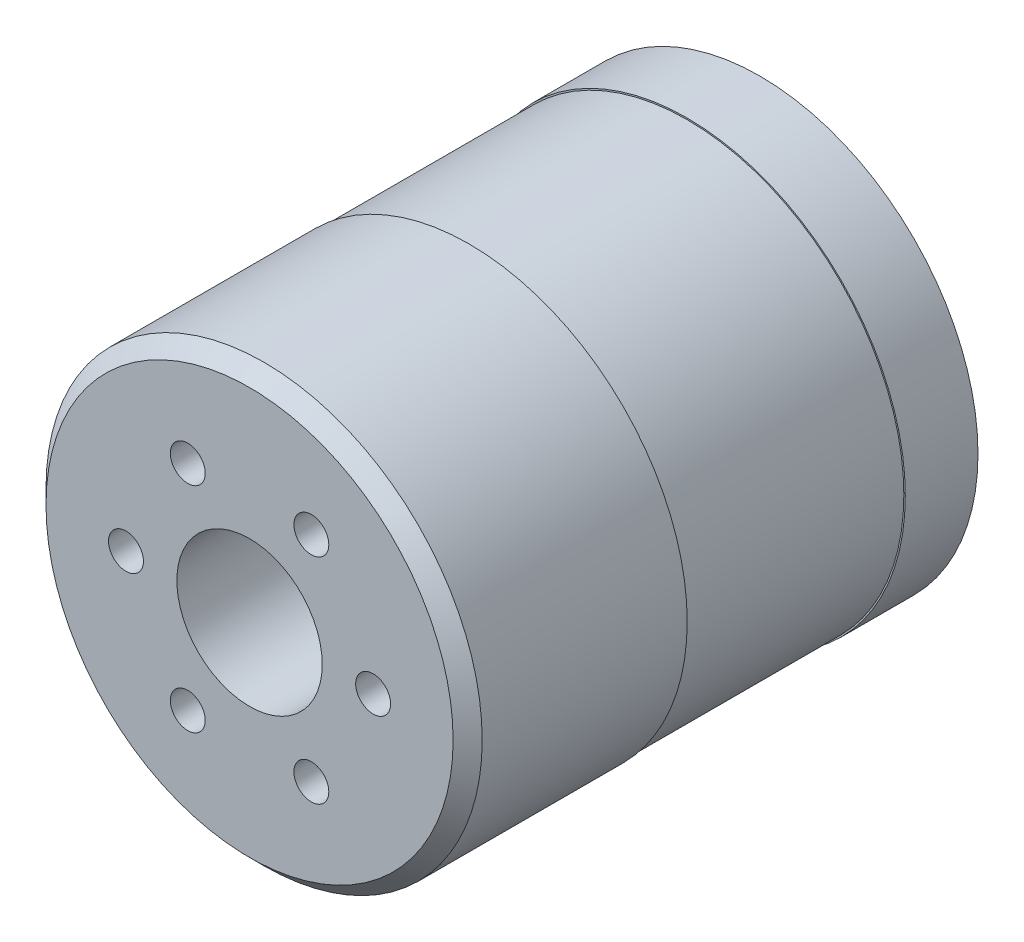
ISO-10303-21;
HEADER;
FILE_DESCRIPTION(('STEP AP214'),'2;1');
FILE_NAME('part.step','',(''),(''),'','','');
FILE_SCHEMA(('AUTOMOTIVE_DESIGN { 1 0 10303 214 1 1 1 1 }'));
ENDSEC;
DATA;
#1=APPLICATION_CONTEXT('core data for automotive mechanical design processes');
#2=APPLICATION_PROTOCOL_DEFINITION('international standard','automotive_design',2000,#1);
#3=PRODUCT_CONTEXT('',#1,'mechanical');
#4=PRODUCT('Part','Part','',(#3));
#5=PRODUCT_RELATED_PRODUCT_CATEGORY('part','',(#4));
#6=PRODUCT_DEFINITION_FORMATION('','',#4);
#7=PRODUCT_DEFINITION_CONTEXT('part definition',#1,'design');
#8=PRODUCT_DEFINITION('design','',#6,#7);
#9=PRODUCT_DEFINITION_SHAPE('','',#8);
#10=(LENGTH_UNIT() NAMED_UNIT(*) SI_UNIT(.MILLI.,.METRE.));
#11=(NAMED_UNIT(*) PLANE_ANGLE_UNIT() SI_UNIT($,.RADIAN.));
#12=(NAMED_UNIT(*) SI_UNIT($,.STERADIAN.) SOLID_ANGLE_UNIT());
#13=UNCERTAINTY_MEASURE_WITH_UNIT(LENGTH_MEASURE(1.E-05),#10,'distance_accuracy_value','');
#14=(GEOMETRIC_REPRESENTATION_CONTEXT(3) GLOBAL_UNCERTAINTY_ASSIGNED_CONTEXT((#13)) GLOBAL_UNIT_ASSIGNED_CONTEXT((#10,
#11,#12)) REPRESENTATION_CONTEXT('',''));
#15=CARTESIAN_POINT('',(0.,0.,0.));
#16=DIRECTION('',(0.,0.,1.));
#17=DIRECTION('',(1.,0.,0.));
#18=AXIS2_PLACEMENT_3D('',#15,#16,#17);
#19=CARTESIAN_POINT('',(0.,0.,0.));
#20=DIRECTION('',(0.,0.,1.));
#21=DIRECTION('',(1.,0.,0.));
#22=AXIS2_PLACEMENT_3D('',#19,#20,#21);
#23=PLANE('',#22);
#24=CARTESIAN_POINT('',(-13.,0.,0.));
#25=DIRECTION('',(0.,0.,-1.));
#26=DIRECTION('',(-1.,0.,0.));
#27=AXIS2_PLACEMENT_3D('',#24,#25,#26);
#28=CIRCLE('',#27,1.25);
#29=CARTESIAN_POINT('',(-14.25,0.,0.));
#30=VERTEX_POINT('',#29);
#31=EDGE_CURVE('E130',#30,#30,#28,.T.);
#32=ORIENTED_EDGE('',*,*,#31,.F.);
#33=EDGE_LOOP('',(#32));
#34=FACE_BOUND('',#33,.T.);
#35=CARTESIAN_POINT('',(0.,13.,0.));
#36=DIRECTION('',(0.,0.,-1.));
#37=DIRECTION('',(-1.,0.,0.));
#38=AXIS2_PLACEMENT_3D('',#35,#36,#37);
#39=CIRCLE('',#38,1.25);
#40=CARTESIAN_POINT('',(-1.25,13.,0.));
#41=VERTEX_POINT('',#40);
#42=EDGE_CURVE('E136',#41,#41,#39,.T.);
#43=ORIENTED_EDGE('',*,*,#42,.F.);
#44=EDGE_LOOP('',(#43));
#45=FACE_BOUND('',#44,.T.);
#46=CARTESIAN_POINT('',(13.,0.,0.));
#47=DIRECTION('',(0.,0.,-1.));
#48=DIRECTION('',(-1.,0.,0.));
#49=AXIS2_PLACEMENT_3D('',#46,#47,#48);
#50=CIRCLE('',#49,1.25);
#51=CARTESIAN_POINT('',(11.75,0.,0.));
#52=VERTEX_POINT('',#51);
#53=EDGE_CURVE('E142',#52,#52,#50,.T.);
#54=ORIENTED_EDGE('',*,*,#53,.F.);
#55=EDGE_LOOP('',(#54));
#56=FACE_BOUND('',#55,.T.);
#57=CARTESIAN_POINT('',(0.,-13.,0.));
#58=DIRECTION('',(0.,0.,-1.));
#59=DIRECTION('',(-1.,0.,0.));
#60=AXIS2_PLACEMENT_3D('',#57,#58,#59);
#61=CIRCLE('',#60,1.25);
#62=CARTESIAN_POINT('',(-1.25,-13.,0.));
#63=VERTEX_POINT('',#62);
#64=EDGE_CURVE('E148',#63,#63,#61,.T.);
#65=ORIENTED_EDGE('',*,*,#64,.F.);
#66=EDGE_LOOP('',(#65));
#67=FACE_BOUND('',#66,.T.);
#68=CARTESIAN_POINT('',(0.,0.,0.));
#69=DIRECTION('',(0.,0.,1.));
#70=DIRECTION('',(1.,0.,0.));
#71=AXIS2_PLACEMENT_3D('',#68,#69,#70);
#72=CIRCLE('',#71,9.);
#73=CARTESIAN_POINT('',(9.,0.,0.));
#74=VERTEX_POINT('',#73);
#75=EDGE_CURVE('E178',#74,#74,#72,.F.);
#76=ORIENTED_EDGE('',*,*,#75,.F.);
#77=EDGE_LOOP('',(#76));
#78=FACE_BOUND('',#77,.T.);
#79=CARTESIAN_POINT('',(0.,0.,0.));
#80=DIRECTION('',(0.,0.,-1.));
#81=DIRECTION('',(-1.,0.,0.));
#82=AXIS2_PLACEMENT_3D('',#79,#80,#81);
#83=CIRCLE('',#82,15.);
#84=CARTESIAN_POINT('',(-15.,0.,0.));
#85=VERTEX_POINT('',#84);
#86=EDGE_CURVE('E151',#85,#85,#83,.T.);
#87=ORIENTED_EDGE('',*,*,#86,.T.);
#88=EDGE_LOOP('',(#87));
#89=FACE_BOUND('',#88,.T.);
#90=ADVANCED_FACE('F36',(#34,#45,#56,#67,#78,#89),#23,.F.);
#91=CARTESIAN_POINT('',(0.,0.,-4.5));
#92=DIRECTION('',(0.,0.,-1.));
#93=DIRECTION('',(-1.,0.,0.));
#94=AXIS2_PLACEMENT_3D('',#91,#92,#93);
#95=PLANE('',#94);
#96=CARTESIAN_POINT('',(0.,0.,-4.5));
#97=DIRECTION('',(0.,0.,-1.));
#98=DIRECTION('',(-1.,0.,0.));
#99=AXIS2_PLACEMENT_3D('',#96,#97,#98);
#100=CIRCLE('',#99,5.);
#101=CARTESIAN_POINT('',(-5.,0.,-4.5));
#102=VERTEX_POINT('',#101);
#103=EDGE_CURVE('E170',#102,#102,#100,.T.);
#104=ORIENTED_EDGE('',*,*,#103,.T.);
#105=EDGE_LOOP('',(#104));
#106=FACE_BOUND('',#105,.T.);
#107=CARTESIAN_POINT('',(0.,0.,-4.5));
#108=DIRECTION('',(0.,0.,-1.));
#109=DIRECTION('',(-1.,0.,0.));
#110=AXIS2_PLACEMENT_3D('',#107,#108,#109);
#111=CIRCLE('',#110,4.);
#112=CARTESIAN_POINT('',(-4.,0.,-4.5));
#113=VERTEX_POINT('',#112);
#114=EDGE_CURVE('E166',#113,#113,#111,.T.);
#115=ORIENTED_EDGE('',*,*,#114,.F.);
#116=EDGE_LOOP('',(#115));
#117=FACE_BOUND('',#116,.T.);
#118=ADVANCED_FACE('F200',(#106,#117),#95,.T.);
#119=CARTESIAN_POINT('',(0.,0.,-4.));
#120=DIRECTION('',(0.,0.,-1.));
#121=DIRECTION('',(-1.,0.,0.));
#122=AXIS2_PLACEMENT_3D('',#119,#120,#121);
#123=PLANE('',#122);
#124=CARTESIAN_POINT('',(0.,0.,-4.));
#125=DIRECTION('',(0.,0.,-1.));
#126=DIRECTION('',(-1.,0.,0.));
#127=AXIS2_PLACEMENT_3D('',#124,#125,#126);
#128=CIRCLE('',#127,9.);
#129=CARTESIAN_POINT('',(-9.,0.,-4.));
#130=VERTEX_POINT('',#129);
#131=EDGE_CURVE('E173',#130,#130,#128,.T.);
#132=ORIENTED_EDGE('',*,*,#131,.T.);
#133=EDGE_LOOP('',(#132));
#134=FACE_BOUND('',#133,.T.);
#135=CARTESIAN_POINT('',(0.,0.,-4.));
#136=DIRECTION('',(0.,0.,-1.));
#137=DIRECTION('',(-1.,0.,0.));
#138=AXIS2_PLACEMENT_3D('',#135,#136,#137);
#139=CIRCLE('',#138,5.);
#140=CARTESIAN_POINT('',(-5.,0.,-4.));
#141=VERTEX_POINT('',#140);
#142=EDGE_CURVE('E169',#141,#141,#139,.T.);
#143=ORIENTED_EDGE('',*,*,#142,.F.);
#144=EDGE_LOOP('',(#143));
#145=FACE_BOUND('',#144,.T.);
#146=ADVANCED_FACE('F206',(#134,#145),#123,.T.);
#147=CARTESIAN_POINT('',(0.,0.,-4.));
#148=DIRECTION('',(0.,0.,1.));
#149=DIRECTION('',(1.,0.,0.));
#150=AXIS2_PLACEMENT_3D('',#147,#148,#149);
#151=CYLINDRICAL_SURFACE('',#150,9.);
#152=ORIENTED_EDGE('',*,*,#131,.F.);
#153=EDGE_LOOP('',(#152));
#154=FACE_BOUND('',#153,.T.);
#155=ORIENTED_EDGE('',*,*,#75,.T.);
#156=EDGE_LOOP('',(#155));
#157=FACE_BOUND('',#156,.T.);
#158=ADVANCED_FACE('F212',(#154,#157),#151,.T.);
#159=CARTESIAN_POINT('',(0.,0.,-4.5));
#160=DIRECTION('',(0.,0.,1.));
#161=DIRECTION('',(1.,0.,0.));
#162=AXIS2_PLACEMENT_3D('',#159,#160,#161);
#163=CYLINDRICAL_SURFACE('',#162,5.);
#164=ORIENTED_EDGE('',*,*,#103,.F.);
#165=EDGE_LOOP('',(#164));
#166=FACE_BOUND('',#165,.T.);
#167=ORIENTED_EDGE('',*,*,#142,.T.);
#168=EDGE_LOOP('',(#167));
#169=FACE_BOUND('',#168,.T.);
#170=ADVANCED_FACE('F215',(#166,#169),#163,.T.);
#171=CARTESIAN_POINT('',(0.,0.,-4.501));
#172=DIRECTION('',(0.,0.,1.));
#173=DIRECTION('',(1.,0.,0.));
#174=AXIS2_PLACEMENT_3D('',#171,#172,#173);
#175=CYLINDRICAL_SURFACE('',#174,4.);
#176=ORIENTED_EDGE('',*,*,#114,.T.);
#177=EDGE_LOOP('',(#176));
#178=FACE_BOUND('',#177,.T.);
#179=CARTESIAN_POINT('',(0.,0.,0.));
#180=DIRECTION('',(0.,0.,-1.));
#181=DIRECTION('',(-1.,0.,0.));
#182=AXIS2_PLACEMENT_3D('',#179,#180,#181);
#183=CIRCLE('',#182,4.);
#184=CARTESIAN_POINT('',(-4.,0.,0.));
#185=VERTEX_POINT('',#184);
#186=EDGE_CURVE('E163',#185,#185,#183,.T.);
#187=ORIENTED_EDGE('',*,*,#186,.F.);
#188=EDGE_LOOP('',(#187));
#189=FACE_BOUND('',#188,.T.);
#190=ADVANCED_FACE('F221',(#178,#189),#175,.F.);
#191=CARTESIAN_POINT('',(0.,0.,0.));
#192=DIRECTION('',(0.,0.,-1.));
#193=DIRECTION('',(-1.,0.,0.));
#194=AXIS2_PLACEMENT_3D('',#191,#192,#193);
#195=PLANE('',#194);
#196=ORIENTED_EDGE('',*,*,#186,.T.);
#197=EDGE_LOOP('',(#196));
#198=FACE_BOUND('',#197,.T.);
#199=ADVANCED_FACE('F226',(#198),#195,.T.);
#200=CARTESIAN_POINT('',(0.,0.,5.));
#201=DIRECTION('',(0.,0.,-1.));
#202=DIRECTION('',(-1.,0.,0.));
#203=AXIS2_PLACEMENT_3D('',#200,#201,#202);
#204=CYLINDRICAL_SURFACE('',#203,15.);
#205=CARTESIAN_POINT('',(0.,0.,5.));
#206=DIRECTION('',(0.,0.,-1.));
#207=DIRECTION('',(-1.,0.,0.));
#208=AXIS2_PLACEMENT_3D('',#205,#206,#207);
#209=CIRCLE('',#208,15.);
#210=CARTESIAN_POINT('',(-15.,0.,5.));
#211=VERTEX_POINT('',#210);
#212=EDGE_CURVE('E152',#211,#211,#209,.T.);
#213=ORIENTED_EDGE('',*,*,#212,.T.);
#214=EDGE_LOOP('',(#213));
#215=FACE_BOUND('',#214,.T.);
#216=ORIENTED_EDGE('',*,*,#86,.F.);
#217=EDGE_LOOP('',(#216));
#218=FACE_BOUND('',#217,.T.);
#219=ADVANCED_FACE('F230',(#215,#218),#204,.T.);
#220=CARTESIAN_POINT('',(0.,0.,5.));
#221=DIRECTION('',(0.,0.,-1.));
#222=DIRECTION('',(-1.,0.,0.));
#223=AXIS2_PLACEMENT_3D('',#220,#221,#222);
#224=PLANE('',#223);
#225=CARTESIAN_POINT('',(0.,0.,5.));
#226=DIRECTION('',(0.,0.,-1.));
#227=DIRECTION('',(-1.,0.,0.));
#228=AXIS2_PLACEMENT_3D('',#225,#226,#227);
#229=CIRCLE('',#228,14.9);
#230=CARTESIAN_POINT('',(-14.9,0.,5.));
#231=VERTEX_POINT('',#230);
#232=EDGE_CURVE('E40',#231,#231,#229,.F.);
#233=ORIENTED_EDGE('',*,*,#232,.F.);
#234=EDGE_LOOP('',(#233));
#235=FACE_BOUND('',#234,.T.);
#236=ORIENTED_EDGE('',*,*,#212,.F.);
#237=EDGE_LOOP('',(#236));
#238=FACE_BOUND('',#237,.T.);
#239=ADVANCED_FACE('F195',(#235,#238),#224,.F.);
#240=CARTESIAN_POINT('',(0.,0.,35.1));
#241=DIRECTION('',(0.,0.,1.));
#242=DIRECTION('',(1.,0.,0.));
#243=AXIS2_PLACEMENT_3D('',#240,#241,#242);
#244=PLANE('',#243);
#245=CARTESIAN_POINT('',(4.25000000000004,-7.36121593216771,35.1));
#246=DIRECTION('',(0.,0.,1.));
#247=DIRECTION('',(1.,0.,0.));
#248=AXIS2_PLACEMENT_3D('',#245,#246,#247);
#249=CIRCLE('',#248,1.19999999999999);
#250=CARTESIAN_POINT('',(5.45000000000003,-7.36121593216771,35.1));
#251=VERTEX_POINT('',#250);
#252=EDGE_CURVE('E87',#251,#251,#249,.T.);
#253=ORIENTED_EDGE('',*,*,#252,.F.);
#254=EDGE_LOOP('',(#253));
#255=FACE_BOUND('',#254,.T.);
#256=CARTESIAN_POINT('',(-4.24999999999998,-7.36121593216774,35.1));
#257=DIRECTION('',(0.,0.,1.));
#258=DIRECTION('',(1.,0.,0.));
#259=AXIS2_PLACEMENT_3D('',#256,#257,#258);
#260=CIRCLE('',#259,1.19999999999999);
#261=CARTESIAN_POINT('',(-3.04999999999999,-7.36121593216774,35.1));
#262=VERTEX_POINT('',#261);
#263=EDGE_CURVE('E86',#262,#262,#260,.T.);
#264=ORIENTED_EDGE('',*,*,#263,.F.);
#265=EDGE_LOOP('',(#264));
#266=FACE_BOUND('',#265,.T.);
#267=CARTESIAN_POINT('',(-8.5,0.,35.1));
#268=DIRECTION('',(0.,0.,1.));
#269=DIRECTION('',(1.,0.,0.));
#270=AXIS2_PLACEMENT_3D('',#267,#268,#269);
#271=CIRCLE('',#270,1.19999999999999);
#272=CARTESIAN_POINT('',(-7.30000000000001,0.,35.1));
#273=VERTEX_POINT('',#272);
#274=EDGE_CURVE('E97',#273,#273,#271,.T.);
#275=ORIENTED_EDGE('',*,*,#274,.F.);
#276=EDGE_LOOP('',(#275));
#277=FACE_BOUND('',#276,.T.);
#278=CARTESIAN_POINT('',(-4.25000000000004,7.36121593216771,35.1));
#279=DIRECTION('',(0.,0.,1.));
#280=DIRECTION('',(1.,0.,0.));
#281=AXIS2_PLACEMENT_3D('',#278,#279,#280);
#282=CIRCLE('',#281,1.19999999999999);
#283=CARTESIAN_POINT('',(-3.05000000000005,7.36121593216771,35.1));
#284=VERTEX_POINT('',#283);
#285=EDGE_CURVE('E103',#284,#284,#282,.T.);
#286=ORIENTED_EDGE('',*,*,#285,.F.);
#287=EDGE_LOOP('',(#286));
#288=FACE_BOUND('',#287,.T.);
#289=CARTESIAN_POINT('',(4.24999999999998,7.36121593216774,35.1));
#290=DIRECTION('',(0.,0.,1.));
#291=DIRECTION('',(1.,0.,0.));
#292=AXIS2_PLACEMENT_3D('',#289,#290,#291);
#293=CIRCLE('',#292,1.19999999999999);
#294=CARTESIAN_POINT('',(5.44999999999997,7.36121593216774,35.1));
#295=VERTEX_POINT('',#294);
#296=EDGE_CURVE('E109',#295,#295,#293,.T.);
#297=ORIENTED_EDGE('',*,*,#296,.F.);
#298=EDGE_LOOP('',(#297));
#299=FACE_BOUND('',#298,.T.);
#300=CARTESIAN_POINT('',(8.5,0.,35.1));
#301=DIRECTION('',(0.,0.,1.));
#302=DIRECTION('',(1.,0.,0.));
#303=AXIS2_PLACEMENT_3D('',#300,#301,#302);
#304=CIRCLE('',#303,1.19999999999999);
#305=CARTESIAN_POINT('',(9.69999999999999,0.,35.1));
#306=VERTEX_POINT('',#305);
#307=EDGE_CURVE('E115',#306,#306,#304,.T.);
#308=ORIENTED_EDGE('',*,*,#307,.F.);
#309=EDGE_LOOP('',(#308));
#310=FACE_BOUND('',#309,.T.);
#311=CARTESIAN_POINT('',(0.,0.,35.1));
#312=DIRECTION('',(0.,0.,1.));
#313=DIRECTION('',(1.,0.,0.));
#314=AXIS2_PLACEMENT_3D('',#311,#312,#313);
#315=CIRCLE('',#314,5.);
#316=CARTESIAN_POINT('',(5.,0.,35.1));
#317=VERTEX_POINT('',#316);
#318=EDGE_CURVE('E121',#317,#317,#315,.T.);
#319=ORIENTED_EDGE('',*,*,#318,.F.);
#320=EDGE_LOOP('',(#319));
#321=FACE_BOUND('',#320,.T.);
#322=CARTESIAN_POINT('',(0.,0.,35.1));
#323=DIRECTION('',(0.,0.,1.));
#324=DIRECTION('',(1.,0.,0.));
#325=AXIS2_PLACEMENT_3D('',#322,#323,#324);
#326=CIRCLE('',#325,14.);
#327=CARTESIAN_POINT('',(14.,0.,35.1));
#328=VERTEX_POINT('',#327);
#329=EDGE_CURVE('E45',#328,#328,#326,.T.);
#330=ORIENTED_EDGE('',*,*,#329,.T.);
#331=EDGE_LOOP('',(#330));
#332=FACE_BOUND('',#331,.T.);
#333=ADVANCED_FACE('F184',(#255,#266,#277,#288,#299,#310,#321,#332),#244,.T.);
#334=CARTESIAN_POINT('',(0.,0.,35.1));
#335=DIRECTION('',(0.,0.,-1.));
#336=DIRECTION('',(-1.,0.,0.));
#337=AXIS2_PLACEMENT_3D('',#334,#335,#336);
#338=CONICAL_SURFACE('',#337,14.,0.785398163397446);
#339=CARTESIAN_POINT('',(0.,0.,34.1));
#340=DIRECTION('',(0.,0.,1.));
#341=DIRECTION('',(1.,0.,0.));
#342=AXIS2_PLACEMENT_3D('',#339,#340,#341);
#343=CIRCLE('',#342,15.);
#344=CARTESIAN_POINT('',(15.,0.,34.1));
#345=VERTEX_POINT('',#344);
#346=EDGE_CURVE('E11',#345,#345,#343,.F.);
#347=ORIENTED_EDGE('',*,*,#346,.F.);
#348=EDGE_LOOP('',(#347));
#349=FACE_BOUND('',#348,.T.);
#350=ORIENTED_EDGE('',*,*,#329,.F.);
#351=EDGE_LOOP('',(#350));
#352=FACE_BOUND('',#351,.T.);
#353=ADVANCED_FACE('F38',(#349,#352),#338,.T.);
#354=CARTESIAN_POINT('',(0.,0.,35.1));
#355=DIRECTION('',(0.,0.,-1.));
#356=DIRECTION('',(-1.,0.,0.));
#357=AXIS2_PLACEMENT_3D('',#354,#355,#356);
#358=CYLINDRICAL_SURFACE('',#357,15.);
#359=ORIENTED_EDGE('',*,*,#346,.T.);
#360=EDGE_LOOP('',(#359));
#361=FACE_BOUND('',#360,.T.);
#362=CARTESIAN_POINT('',(0.,0.,20.));
#363=DIRECTION('',(0.,0.,-1.));
#364=DIRECTION('',(-1.,0.,0.));
#365=AXIS2_PLACEMENT_3D('',#362,#363,#364);
#366=CIRCLE('',#365,15.);
#367=CARTESIAN_POINT('',(-15.,0.,20.));
#368=VERTEX_POINT('',#367);
#369=EDGE_CURVE('E160',#368,#368,#366,.T.);
#370=ORIENTED_EDGE('',*,*,#369,.F.);
#371=EDGE_LOOP('',(#370));
#372=FACE_BOUND('',#371,.T.);
#373=ADVANCED_FACE('F187',(#361,#372),#358,.T.);
#374=CARTESIAN_POINT('',(0.,0.,20.));
#375=DIRECTION('',(0.,0.,-1.));
#376=DIRECTION('',(-1.,0.,0.));
#377=AXIS2_PLACEMENT_3D('',#374,#375,#376);
#378=PLANE('',#377);
#379=CARTESIAN_POINT('',(0.,0.,20.));
#380=DIRECTION('',(0.,0.,-1.));
#381=DIRECTION('',(-1.,0.,0.));
#382=AXIS2_PLACEMENT_3D('',#379,#380,#381);
#383=CIRCLE('',#382,14.9);
#384=CARTESIAN_POINT('',(-14.9,0.,20.));
#385=VERTEX_POINT('',#384);
#386=EDGE_CURVE('E157',#385,#385,#383,.T.);
#387=ORIENTED_EDGE('',*,*,#386,.F.);
#388=EDGE_LOOP('',(#387));
#389=FACE_BOUND('',#388,.T.);
#390=ORIENTED_EDGE('',*,*,#369,.T.);
#391=EDGE_LOOP('',(#390));
#392=FACE_BOUND('',#391,.T.);
#393=ADVANCED_FACE('F193',(#389,#392),#378,.T.);
#394=CARTESIAN_POINT('',(0.,0.,20.));
#395=DIRECTION('',(0.,0.,-1.));
#396=DIRECTION('',(-1.,0.,0.));
#397=AXIS2_PLACEMENT_3D('',#394,#395,#396);
#398=CYLINDRICAL_SURFACE('',#397,14.9);
#399=ORIENTED_EDGE('',*,*,#386,.T.);
#400=EDGE_LOOP('',(#399));
#401=FACE_BOUND('',#400,.T.);
#402=ORIENTED_EDGE('',*,*,#232,.T.);
#403=EDGE_LOOP('',(#402));
#404=FACE_BOUND('',#403,.T.);
#405=ADVANCED_FACE('F234',(#401,#404),#398,.T.);
#406=CARTESIAN_POINT('',(0.,-13.,0.));
#407=DIRECTION('',(0.,0.,-1.));
#408=DIRECTION('',(-1.,0.,0.));
#409=AXIS2_PLACEMENT_3D('',#406,#407,#408);
#410=CYLINDRICAL_SURFACE('',#409,1.25);
#411=CARTESIAN_POINT('',(0.,-13.,4.5));
#412=DIRECTION('',(0.,0.,-1.));
#413=DIRECTION('',(-1.,0.,0.));
#414=AXIS2_PLACEMENT_3D('',#411,#412,#413);
#415=CIRCLE('',#414,1.25);
#416=CARTESIAN_POINT('',(-1.25,-13.,4.5));
#417=VERTEX_POINT('',#416);
#418=EDGE_CURVE('E145',#417,#417,#415,.T.);
#419=ORIENTED_EDGE('',*,*,#418,.F.);
#420=EDGE_LOOP('',(#419));
#421=FACE_BOUND('',#420,.T.);
#422=ORIENTED_EDGE('',*,*,#64,.T.);
#423=EDGE_LOOP('',(#422));
#424=FACE_BOUND('',#423,.T.);
#425=ADVANCED_FACE('F238',(#421,#424),#410,.F.);
#426=CARTESIAN_POINT('',(0.,-13.,4.5));
#427=DIRECTION('',(0.,0.,-1.));
#428=DIRECTION('',(-1.,0.,0.));
#429=AXIS2_PLACEMENT_3D('',#426,#427,#428);
#430=CONICAL_SURFACE('',#429,1.25,1.02974425867665);
#431=CARTESIAN_POINT('',(0.,-13.,5.25107577378445));
#432=VERTEX_POINT('',#431);
#433=VERTEX_LOOP('',#432);
#434=FACE_BOUND('',#433,.T.);
#435=ORIENTED_EDGE('',*,*,#418,.T.);
#436=EDGE_LOOP('',(#435));
#437=FACE_BOUND('',#436,.T.);
#438=ADVANCED_FACE('F248',(#434,#437),#430,.F.);
#439=CARTESIAN_POINT('',(13.,0.,0.));
#440=DIRECTION('',(0.,0.,-1.));
#441=DIRECTION('',(-1.,0.,0.));
#442=AXIS2_PLACEMENT_3D('',#439,#440,#441);
#443=CYLINDRICAL_SURFACE('',#442,1.25);
#444=CARTESIAN_POINT('',(13.,0.,4.5));
#445=DIRECTION('',(0.,0.,-1.));
#446=DIRECTION('',(-1.,0.,0.));
#447=AXIS2_PLACEMENT_3D('',#444,#445,#446);
#448=CIRCLE('',#447,1.25);
#449=CARTESIAN_POINT('',(11.75,0.,4.5));
#450=VERTEX_POINT('',#449);
#451=EDGE_CURVE('E139',#450,#450,#448,.T.);
#452=ORIENTED_EDGE('',*,*,#451,.F.);
#453=EDGE_LOOP('',(#452));
#454=FACE_BOUND('',#453,.T.);
#455=ORIENTED_EDGE('',*,*,#53,.T.);
#456=EDGE_LOOP('',(#455));
#457=FACE_BOUND('',#456,.T.);
#458=ADVANCED_FACE('F252',(#454,#457),#443,.F.);
#459=CARTESIAN_POINT('',(13.,0.,4.5));
#460=DIRECTION('',(0.,0.,-1.));
#461=DIRECTION('',(-1.,0.,0.));
#462=AXIS2_PLACEMENT_3D('',#459,#460,#461);
#463=CONICAL_SURFACE('',#462,1.25,1.02974425867665);
#464=CARTESIAN_POINT('',(13.,0.,5.25107577378445));
#465=VERTEX_POINT('',#464);
#466=VERTEX_LOOP('',#465);
#467=FACE_BOUND('',#466,.T.);
#468=ORIENTED_EDGE('',*,*,#451,.T.);
#469=EDGE_LOOP('',(#468));
#470=FACE_BOUND('',#469,.T.);
#471=ADVANCED_FACE('F255',(#467,#470),#463,.F.);
#472=CARTESIAN_POINT('',(0.,13.,0.));
#473=DIRECTION('',(0.,0.,-1.));
#474=DIRECTION('',(-1.,0.,0.));
#475=AXIS2_PLACEMENT_3D('',#472,#473,#474);
#476=CYLINDRICAL_SURFACE('',#475,1.25);
#477=CARTESIAN_POINT('',(0.,13.,4.5));
#478=DIRECTION('',(0.,0.,-1.));
#479=DIRECTION('',(-1.,0.,0.));
#480=AXIS2_PLACEMENT_3D('',#477,#478,#479);
#481=CIRCLE('',#480,1.25);
#482=CARTESIAN_POINT('',(-1.25,13.,4.5));
#483=VERTEX_POINT('',#482);
#484=EDGE_CURVE('E133',#483,#483,#481,.T.);
#485=ORIENTED_EDGE('',*,*,#484,.F.);
#486=EDGE_LOOP('',(#485));
#487=FACE_BOUND('',#486,.T.);
#488=ORIENTED_EDGE('',*,*,#42,.T.);
#489=EDGE_LOOP('',(#488));
#490=FACE_BOUND('',#489,.T.);
#491=ADVANCED_FACE('F259',(#487,#490),#476,.F.);
#492=CARTESIAN_POINT('',(0.,13.,4.5));
#493=DIRECTION('',(0.,0.,-1.));
#494=DIRECTION('',(-1.,0.,0.));
#495=AXIS2_PLACEMENT_3D('',#492,#493,#494);
#496=CONICAL_SURFACE('',#495,1.25,1.02974425867665);
#497=CARTESIAN_POINT('',(0.,13.,5.25107577378445));
#498=VERTEX_POINT('',#497);
#499=VERTEX_LOOP('',#498);
#500=FACE_BOUND('',#499,.T.);
#501=ORIENTED_EDGE('',*,*,#484,.T.);
#502=EDGE_LOOP('',(#501));
#503=FACE_BOUND('',#502,.T.);
#504=ADVANCED_FACE('F262',(#500,#503),#496,.F.);
#505=CARTESIAN_POINT('',(-13.,0.,0.));
#506=DIRECTION('',(0.,0.,-1.));
#507=DIRECTION('',(-1.,0.,0.));
#508=AXIS2_PLACEMENT_3D('',#505,#506,#507);
#509=CYLINDRICAL_SURFACE('',#508,1.25);
#510=CARTESIAN_POINT('',(-13.,0.,4.5));
#511=DIRECTION('',(0.,0.,-1.));
#512=DIRECTION('',(-1.,0.,0.));
#513=AXIS2_PLACEMENT_3D('',#510,#511,#512);
#514=CIRCLE('',#513,1.25);
#515=CARTESIAN_POINT('',(-14.25,0.,4.5));
#516=VERTEX_POINT('',#515);
#517=EDGE_CURVE('E125',#516,#516,#514,.T.);
#518=ORIENTED_EDGE('',*,*,#517,.F.);
#519=EDGE_LOOP('',(#518));
#520=FACE_BOUND('',#519,.T.);
#521=ORIENTED_EDGE('',*,*,#31,.T.);
#522=EDGE_LOOP('',(#521));
#523=FACE_BOUND('',#522,.T.);
#524=ADVANCED_FACE('F266',(#520,#523),#509,.F.);
#525=CARTESIAN_POINT('',(-13.,0.,4.5));
#526=DIRECTION('',(0.,0.,-1.));
#527=DIRECTION('',(-1.,0.,0.));
#528=AXIS2_PLACEMENT_3D('',#525,#526,#527);
#529=CONICAL_SURFACE('',#528,1.25,1.02974425867665);
#530=CARTESIAN_POINT('',(-13.,0.,5.25107577378445));
#531=VERTEX_POINT('',#530);
#532=VERTEX_LOOP('',#531);
#533=FACE_BOUND('',#532,.T.);
#534=ORIENTED_EDGE('',*,*,#517,.T.);
#535=EDGE_LOOP('',(#534));
#536=FACE_BOUND('',#535,.T.);
#537=ADVANCED_FACE('F270',(#533,#536),#529,.F.);
#538=CARTESIAN_POINT('',(0.,0.,20.1));
#539=DIRECTION('',(0.,0.,1.));
#540=DIRECTION('',(1.,0.,0.));
#541=AXIS2_PLACEMENT_3D('',#538,#539,#540);
#542=CYLINDRICAL_SURFACE('',#541,5.);
#543=CARTESIAN_POINT('',(0.,0.,20.1));
#544=DIRECTION('',(0.,0.,1.));
#545=DIRECTION('',(1.,0.,0.));
#546=AXIS2_PLACEMENT_3D('',#543,#544,#545);
#547=CIRCLE('',#546,5.);
#548=CARTESIAN_POINT('',(5.,0.,20.1));
#549=VERTEX_POINT('',#548);
#550=EDGE_CURVE('E122',#549,#549,#547,.T.);
#551=ORIENTED_EDGE('',*,*,#550,.F.);
#552=EDGE_LOOP('',(#551));
#553=FACE_BOUND('',#552,.T.);
#554=ORIENTED_EDGE('',*,*,#318,.T.);
#555=EDGE_LOOP('',(#554));
#556=FACE_BOUND('',#555,.T.);
#557=ADVANCED_FACE('F274',(#553,#556),#542,.F.);
#558=CARTESIAN_POINT('',(0.,0.,20.1));
#559=DIRECTION('',(0.,0.,1.));
#560=DIRECTION('',(1.,0.,0.));
#561=AXIS2_PLACEMENT_3D('',#558,#559,#560);
#562=PLANE('',#561);
#563=ORIENTED_EDGE('',*,*,#550,.T.);
#564=EDGE_LOOP('',(#563));
#565=FACE_BOUND('',#564,.T.);
#566=ADVANCED_FACE('F278',(#565),#562,.T.);
#567=CARTESIAN_POINT('',(8.5,0.,32.1));
#568=DIRECTION('',(0.,0.,1.));
#569=DIRECTION('',(1.,0.,0.));
#570=AXIS2_PLACEMENT_3D('',#567,#568,#569);
#571=CONICAL_SURFACE('',#570,1.2,1.02974425867666);
#572=CARTESIAN_POINT('',(8.5,0.,31.3789672571669));
#573=VERTEX_POINT('',#572);
#574=VERTEX_LOOP('',#573);
#575=FACE_BOUND('',#574,.T.);
#576=CARTESIAN_POINT('',(8.5,0.,32.1));
#577=DIRECTION('',(0.,0.,1.));
#578=DIRECTION('',(1.,0.,0.));
#579=AXIS2_PLACEMENT_3D('',#576,#577,#578);
#580=CIRCLE('',#579,1.2);
#581=CARTESIAN_POINT('',(9.7,0.,32.1));
#582=VERTEX_POINT('',#581);
#583=EDGE_CURVE('E118',#582,#582,#580,.T.);
#584=ORIENTED_EDGE('',*,*,#583,.T.);
#585=EDGE_LOOP('',(#584));
#586=FACE_BOUND('',#585,.T.);
#587=ADVANCED_FACE('F282',(#575,#586),#571,.F.);
#588=CARTESIAN_POINT('',(8.5,0.,35.1));
#589=DIRECTION('',(0.,0.,1.));
#590=DIRECTION('',(1.,0.,0.));
#591=AXIS2_PLACEMENT_3D('',#588,#589,#590);
#592=CYLINDRICAL_SURFACE('',#591,1.19999999999999);
#593=ORIENTED_EDGE('',*,*,#583,.F.);
#594=EDGE_LOOP('',(#593));
#595=FACE_BOUND('',#594,.T.);
#596=ORIENTED_EDGE('',*,*,#307,.T.);
#597=EDGE_LOOP('',(#596));
#598=FACE_BOUND('',#597,.T.);
#599=ADVANCED_FACE('F286',(#595,#598),#592,.F.);
#600=CARTESIAN_POINT('',(4.24999999999998,7.36121593216774,32.1));
#601=DIRECTION('',(0.,0.,1.));
#602=DIRECTION('',(1.,0.,0.));
#603=AXIS2_PLACEMENT_3D('',#600,#601,#602);
#604=CONICAL_SURFACE('',#603,1.2,1.02974425867666);
#605=CARTESIAN_POINT('',(4.24999999999998,7.36121593216774,31.3789672571669));
#606=VERTEX_POINT('',#605);
#607=VERTEX_LOOP('',#606);
#608=FACE_BOUND('',#607,.T.);
#609=CARTESIAN_POINT('',(4.24999999999998,7.36121593216774,32.1));
#610=DIRECTION('',(0.,0.,1.));
#611=DIRECTION('',(1.,0.,0.));
#612=AXIS2_PLACEMENT_3D('',#609,#610,#611);
#613=CIRCLE('',#612,1.2);
#614=CARTESIAN_POINT('',(5.44999999999998,7.36121593216774,32.1));
#615=VERTEX_POINT('',#614);
#616=EDGE_CURVE('E112',#615,#615,#613,.T.);
#617=ORIENTED_EDGE('',*,*,#616,.T.);
#618=EDGE_LOOP('',(#617));
#619=FACE_BOUND('',#618,.T.);
#620=ADVANCED_FACE('F290',(#608,#619),#604,.F.);
#621=CARTESIAN_POINT('',(4.24999999999998,7.36121593216774,35.1));
#622=DIRECTION('',(0.,0.,1.));
#623=DIRECTION('',(1.,0.,0.));
#624=AXIS2_PLACEMENT_3D('',#621,#622,#623);
#625=CYLINDRICAL_SURFACE('',#624,1.19999999999999);
#626=ORIENTED_EDGE('',*,*,#616,.F.);
#627=EDGE_LOOP('',(#626));
#628=FACE_BOUND('',#627,.T.);
#629=ORIENTED_EDGE('',*,*,#296,.T.);
#630=EDGE_LOOP('',(#629));
#631=FACE_BOUND('',#630,.T.);
#632=ADVANCED_FACE('F294',(#628,#631),#625,.F.);
#633=CARTESIAN_POINT('',(-4.25000000000004,7.36121593216771,32.1));
#634=DIRECTION('',(0.,0.,1.));
#635=DIRECTION('',(1.,0.,0.));
#636=AXIS2_PLACEMENT_3D('',#633,#634,#635);
#637=CONICAL_SURFACE('',#636,1.2,1.02974425867666);
#638=CARTESIAN_POINT('',(-4.25000000000004,7.36121593216771,31.3789672571669));
#639=VERTEX_POINT('',#638);
#640=VERTEX_LOOP('',#639);
#641=FACE_BOUND('',#640,.T.);
#642=CARTESIAN_POINT('',(-4.25000000000004,7.36121593216771,32.1));
#643=DIRECTION('',(0.,0.,1.));
#644=DIRECTION('',(1.,0.,0.));
#645=AXIS2_PLACEMENT_3D('',#642,#643,#644);
#646=CIRCLE('',#645,1.2);
#647=CARTESIAN_POINT('',(-3.05000000000004,7.36121593216771,32.1));
#648=VERTEX_POINT('',#647);
#649=EDGE_CURVE('E106',#648,#648,#646,.T.);
#650=ORIENTED_EDGE('',*,*,#649,.T.);
#651=EDGE_LOOP('',(#650));
#652=FACE_BOUND('',#651,.T.);
#653=ADVANCED_FACE('F298',(#641,#652),#637,.F.);
#654=CARTESIAN_POINT('',(-4.25000000000004,7.36121593216771,35.1));
#655=DIRECTION('',(0.,0.,1.));
#656=DIRECTION('',(1.,0.,0.));
#657=AXIS2_PLACEMENT_3D('',#654,#655,#656);
#658=CYLINDRICAL_SURFACE('',#657,1.19999999999999);
#659=ORIENTED_EDGE('',*,*,#649,.F.);
#660=EDGE_LOOP('',(#659));
#661=FACE_BOUND('',#660,.T.);
#662=ORIENTED_EDGE('',*,*,#285,.T.);
#663=EDGE_LOOP('',(#662));
#664=FACE_BOUND('',#663,.T.);
#665=ADVANCED_FACE('F302',(#661,#664),#658,.F.);
#666=CARTESIAN_POINT('',(-8.5,0.,32.1));
#667=DIRECTION('',(0.,0.,1.));
#668=DIRECTION('',(1.,0.,0.));
#669=AXIS2_PLACEMENT_3D('',#666,#667,#668);
#670=CONICAL_SURFACE('',#669,1.2,1.02974425867666);
#671=CARTESIAN_POINT('',(-8.5,0.,31.3789672571669));
#672=VERTEX_POINT('',#671);
#673=VERTEX_LOOP('',#672);
#674=FACE_BOUND('',#673,.T.);
#675=CARTESIAN_POINT('',(-8.5,0.,32.1));
#676=DIRECTION('',(0.,0.,1.));
#677=DIRECTION('',(1.,0.,0.));
#678=AXIS2_PLACEMENT_3D('',#675,#676,#677);
#679=CIRCLE('',#678,1.2);
#680=CARTESIAN_POINT('',(-7.3,0.,32.1));
#681=VERTEX_POINT('',#680);
#682=EDGE_CURVE('E100',#681,#681,#679,.T.);
#683=ORIENTED_EDGE('',*,*,#682,.T.);
#684=EDGE_LOOP('',(#683));
#685=FACE_BOUND('',#684,.T.);
#686=ADVANCED_FACE('F306',(#674,#685),#670,.F.);
#687=CARTESIAN_POINT('',(-8.5,0.,35.1));
#688=DIRECTION('',(0.,0.,1.));
#689=DIRECTION('',(1.,0.,0.));
#690=AXIS2_PLACEMENT_3D('',#687,#688,#689);
#691=CYLINDRICAL_SURFACE('',#690,1.19999999999999);
#692=ORIENTED_EDGE('',*,*,#682,.F.);
#693=EDGE_LOOP('',(#692));
#694=FACE_BOUND('',#693,.T.);
#695=ORIENTED_EDGE('',*,*,#274,.T.);
#696=EDGE_LOOP('',(#695));
#697=FACE_BOUND('',#696,.T.);
#698=ADVANCED_FACE('F310',(#694,#697),#691,.F.);
#699=CARTESIAN_POINT('',(-4.24999999999998,-7.36121593216774,32.1));
#700=DIRECTION('',(0.,0.,1.));
#701=DIRECTION('',(1.,0.,0.));
#702=AXIS2_PLACEMENT_3D('',#699,#700,#701);
#703=CONICAL_SURFACE('',#702,1.2,1.02974425867666);
#704=CARTESIAN_POINT('',(-4.24999999999998,-7.36121593216774,31.3789672571669));
#705=VERTEX_POINT('',#704);
#706=VERTEX_LOOP('',#705);
#707=FACE_BOUND('',#706,.T.);
#708=CARTESIAN_POINT('',(-4.24999999999998,-7.36121593216774,32.1));
#709=DIRECTION('',(0.,0.,1.));
#710=DIRECTION('',(1.,0.,0.));
#711=AXIS2_PLACEMENT_3D('',#708,#709,#710);
#712=CIRCLE('',#711,1.2);
#713=CARTESIAN_POINT('',(-3.04999999999998,-7.36121593216774,32.1));
#714=VERTEX_POINT('',#713);
#715=EDGE_CURVE('E90',#714,#714,#712,.T.);
#716=ORIENTED_EDGE('',*,*,#715,.T.);
#717=EDGE_LOOP('',(#716));
#718=FACE_BOUND('',#717,.T.);
#719=ADVANCED_FACE('F314',(#707,#718),#703,.F.);
#720=CARTESIAN_POINT('',(-4.24999999999998,-7.36121593216774,35.1));
#721=DIRECTION('',(0.,0.,1.));
#722=DIRECTION('',(1.,0.,0.));
#723=AXIS2_PLACEMENT_3D('',#720,#721,#722);
#724=CYLINDRICAL_SURFACE('',#723,1.19999999999999);
#725=ORIENTED_EDGE('',*,*,#715,.F.);
#726=EDGE_LOOP('',(#725));
#727=FACE_BOUND('',#726,.T.);
#728=ORIENTED_EDGE('',*,*,#263,.T.);
#729=EDGE_LOOP('',(#728));
#730=FACE_BOUND('',#729,.T.);
#731=ADVANCED_FACE('F80',(#727,#730),#724,.F.);
#732=CARTESIAN_POINT('',(4.25000000000004,-7.36121593216771,32.1));
#733=DIRECTION('',(0.,0.,1.));
#734=DIRECTION('',(1.,0.,0.));
#735=AXIS2_PLACEMENT_3D('',#732,#733,#734);
#736=CONICAL_SURFACE('',#735,1.2,1.02974425867666);
#737=CARTESIAN_POINT('',(4.25000000000004,-7.36121593216771,31.3789672571669));
#738=VERTEX_POINT('',#737);
#739=VERTEX_LOOP('',#738);
#740=FACE_BOUND('',#739,.T.);
#741=CARTESIAN_POINT('',(4.25000000000004,-7.36121593216771,32.1));
#742=DIRECTION('',(0.,0.,1.));
#743=DIRECTION('',(1.,0.,0.));
#744=AXIS2_PLACEMENT_3D('',#741,#742,#743);
#745=CIRCLE('',#744,1.2);
#746=CARTESIAN_POINT('',(5.45000000000004,-7.36121593216771,32.1));
#747=VERTEX_POINT('',#746);
#748=EDGE_CURVE('E84',#747,#747,#745,.T.);
#749=ORIENTED_EDGE('',*,*,#748,.T.);
#750=EDGE_LOOP('',(#749));
#751=FACE_BOUND('',#750,.T.);
#752=ADVANCED_FACE('F76',(#740,#751),#736,.F.);
#753=CARTESIAN_POINT('',(4.25000000000004,-7.36121593216771,35.1));
#754=DIRECTION('',(0.,0.,1.));
#755=DIRECTION('',(1.,0.,0.));
#756=AXIS2_PLACEMENT_3D('',#753,#754,#755);
#757=CYLINDRICAL_SURFACE('',#756,1.19999999999999);
#758=ORIENTED_EDGE('',*,*,#748,.F.);
#759=EDGE_LOOP('',(#758));
#760=FACE_BOUND('',#759,.T.);
#761=ORIENTED_EDGE('',*,*,#252,.T.);
#762=EDGE_LOOP('',(#761));
#763=FACE_BOUND('',#762,.T.);
#764=ADVANCED_FACE('F79',(#760,#763),#757,.F.);
#765=CLOSED_SHELL('',(#90,#118,#146,#158,#170,#190,#199,#219,#239,#333,#353,#373,#393,#405,#425,
#438,#458,#471,#491,#504,#524,#537,#557,#566,#587,#599,#620,#632,#653,#665,#686,#698,#719,#731,
#752,#764));
#766=MANIFOLD_SOLID_BREP('B2',#765);
#767=ADVANCED_BREP_SHAPE_REPRESENTATION('',(#18,#766),#14);
#768=SHAPE_DEFINITION_REPRESENTATION(#9,#767);
ENDSEC;
END-ISO-10303-21;
